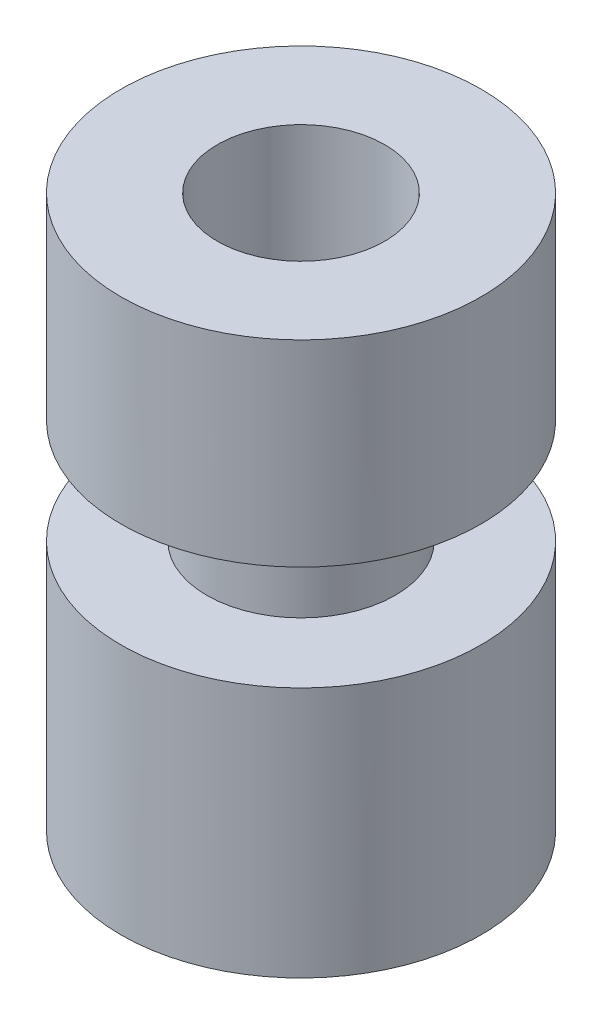
ISO-10303-21;
HEADER;
FILE_DESCRIPTION(('STEP AP214'),'2;1');
FILE_NAME('part.step','',(''),(''),'','','');
FILE_SCHEMA(('AUTOMOTIVE_DESIGN { 1 0 10303 214 1 1 1 1 }'));
ENDSEC;
DATA;
#1=APPLICATION_CONTEXT('core data for automotive mechanical design processes');
#2=APPLICATION_PROTOCOL_DEFINITION('international standard','automotive_design',2000,#1);
#3=PRODUCT_CONTEXT('',#1,'mechanical');
#4=PRODUCT('Part','Part','',(#3));
#5=PRODUCT_RELATED_PRODUCT_CATEGORY('part','',(#4));
#6=PRODUCT_DEFINITION_FORMATION('','',#4);
#7=PRODUCT_DEFINITION_CONTEXT('part definition',#1,'design');
#8=PRODUCT_DEFINITION('design','',#6,#7);
#9=PRODUCT_DEFINITION_SHAPE('','',#8);
#10=(LENGTH_UNIT() NAMED_UNIT(*) SI_UNIT(.MILLI.,.METRE.));
#11=(NAMED_UNIT(*) PLANE_ANGLE_UNIT() SI_UNIT($,.RADIAN.));
#12=(NAMED_UNIT(*) SI_UNIT($,.STERADIAN.) SOLID_ANGLE_UNIT());
#13=UNCERTAINTY_MEASURE_WITH_UNIT(LENGTH_MEASURE(1.E-05),#10,'distance_accuracy_value','');
#14=(GEOMETRIC_REPRESENTATION_CONTEXT(3) GLOBAL_UNCERTAINTY_ASSIGNED_CONTEXT((#13)) GLOBAL_UNIT_ASSIGNED_CONTEXT((#10,
#11,#12)) REPRESENTATION_CONTEXT('',''));
#15=CARTESIAN_POINT('',(0.,0.,0.));
#16=DIRECTION('',(0.,0.,1.));
#17=DIRECTION('',(1.,0.,0.));
#18=AXIS2_PLACEMENT_3D('',#15,#16,#17);
#19=CARTESIAN_POINT('',(0.,6.6,0.));
#20=DIRECTION('',(0.,-1.,0.));
#21=DIRECTION('',(0.,0.,-1.));
#22=AXIS2_PLACEMENT_3D('',#19,#20,#21);
#23=CYLINDRICAL_SURFACE('',#22,2.15);
#24=CARTESIAN_POINT('',(0.,6.6,0.));
#25=DIRECTION('',(0.,1.,0.));
#26=DIRECTION('',(0.,0.,1.));
#27=AXIS2_PLACEMENT_3D('',#24,#25,#26);
#28=CIRCLE('',#27,2.15);
#29=CARTESIAN_POINT('',(0.,6.6,2.15));
#30=VERTEX_POINT('',#29);
#31=EDGE_CURVE('E10',#30,#30,#28,.T.);
#32=ORIENTED_EDGE('',*,*,#31,.F.);
#33=EDGE_LOOP('',(#32));
#34=FACE_BOUND('',#33,.T.);
#35=CARTESIAN_POINT('',(0.,4.25,0.));
#36=DIRECTION('',(0.,-1.,0.));
#37=DIRECTION('',(0.,0.,-1.));
#38=AXIS2_PLACEMENT_3D('',#35,#36,#37);
#39=CIRCLE('',#38,2.15);
#40=CARTESIAN_POINT('',(0.,4.25,-2.15));
#41=VERTEX_POINT('',#40);
#42=EDGE_CURVE('E58',#41,#41,#39,.T.);
#43=ORIENTED_EDGE('',*,*,#42,.F.);
#44=EDGE_LOOP('',(#43));
#45=FACE_BOUND('',#44,.T.);
#46=ADVANCED_FACE('F39',(#34,#45),#23,.T.);
#47=CARTESIAN_POINT('',(0.,3.,0.));
#48=DIRECTION('',(0.,-1.,0.));
#49=DIRECTION('',(0.,0.,-1.));
#50=AXIS2_PLACEMENT_3D('',#47,#48,#49);
#51=CIRCLE('',#50,2.15);
#52=CARTESIAN_POINT('',(0.,3.,-2.15));
#53=VERTEX_POINT('',#52);
#54=EDGE_CURVE('E55',#53,#53,#51,.T.);
#55=ORIENTED_EDGE('',*,*,#54,.T.);
#56=EDGE_LOOP('',(#55));
#57=FACE_BOUND('',#56,.T.);
#58=CARTESIAN_POINT('',(0.,0.,0.));
#59=DIRECTION('',(0.,1.,0.));
#60=DIRECTION('',(0.,0.,1.));
#61=AXIS2_PLACEMENT_3D('',#58,#59,#60);
#62=CIRCLE('',#61,2.15);
#63=CARTESIAN_POINT('',(0.,0.,2.15));
#64=VERTEX_POINT('',#63);
#65=EDGE_CURVE('E43',#64,#64,#62,.T.);
#66=ORIENTED_EDGE('',*,*,#65,.T.);
#67=EDGE_LOOP('',(#66));
#68=FACE_BOUND('',#67,.T.);
#69=ADVANCED_FACE('F41',(#57,#68),#23,.T.);
#70=CARTESIAN_POINT('',(0.,6.6,0.));
#71=DIRECTION('',(0.,1.,0.));
#72=DIRECTION('',(0.,0.,1.));
#73=AXIS2_PLACEMENT_3D('',#70,#71,#72);
#74=PLANE('',#73);
#75=CARTESIAN_POINT('',(0.,6.6,0.));
#76=DIRECTION('',(0.,-1.,0.));
#77=DIRECTION('',(0.,0.,-1.));
#78=AXIS2_PLACEMENT_3D('',#75,#76,#77);
#79=CIRCLE('',#78,1.);
#80=CARTESIAN_POINT('',(0.,6.6,-1.));
#81=VERTEX_POINT('',#80);
#82=EDGE_CURVE('E50',#81,#81,#79,.T.);
#83=ORIENTED_EDGE('',*,*,#82,.T.);
#84=EDGE_LOOP('',(#83));
#85=FACE_BOUND('',#84,.T.);
#86=ORIENTED_EDGE('',*,*,#31,.T.);
#87=EDGE_LOOP('',(#86));
#88=FACE_BOUND('',#87,.T.);
#89=ADVANCED_FACE('F95',(#85,#88),#74,.T.);
#90=CARTESIAN_POINT('',(0.,0.,0.));
#91=DIRECTION('',(0.,1.,0.));
#92=DIRECTION('',(0.,0.,1.));
#93=AXIS2_PLACEMENT_3D('',#90,#91,#92);
#94=PLANE('',#93);
#95=CARTESIAN_POINT('',(0.,0.,0.));
#96=DIRECTION('',(0.,-1.,0.));
#97=DIRECTION('',(0.,0.,-1.));
#98=AXIS2_PLACEMENT_3D('',#95,#96,#97);
#99=CIRCLE('',#98,1.);
#100=CARTESIAN_POINT('',(0.,0.,-1.));
#101=VERTEX_POINT('',#100);
#102=EDGE_CURVE('E52',#101,#101,#99,.T.);
#103=ORIENTED_EDGE('',*,*,#102,.F.);
#104=EDGE_LOOP('',(#103));
#105=FACE_BOUND('',#104,.T.);
#106=ORIENTED_EDGE('',*,*,#65,.F.);
#107=EDGE_LOOP('',(#106));
#108=FACE_BOUND('',#107,.T.);
#109=ADVANCED_FACE('F102',(#105,#108),#94,.F.);
#110=CARTESIAN_POINT('',(0.,6.6,0.));
#111=DIRECTION('',(0.,-1.,0.));
#112=DIRECTION('',(0.,0.,-1.));
#113=AXIS2_PLACEMENT_3D('',#110,#111,#112);
#114=CYLINDRICAL_SURFACE('',#113,1.);
#115=ORIENTED_EDGE('',*,*,#82,.F.);
#116=EDGE_LOOP('',(#115));
#117=FACE_BOUND('',#116,.T.);
#118=ORIENTED_EDGE('',*,*,#102,.T.);
#119=EDGE_LOOP('',(#118));
#120=FACE_BOUND('',#119,.T.);
#121=ADVANCED_FACE('F85',(#117,#120),#114,.F.);
#122=CARTESIAN_POINT('',(0.,3.,0.));
#123=DIRECTION('',(0.,-1.,0.));
#124=DIRECTION('',(0.,0.,-1.));
#125=AXIS2_PLACEMENT_3D('',#122,#123,#124);
#126=PLANE('',#125);
#127=ORIENTED_EDGE('',*,*,#54,.F.);
#128=EDGE_LOOP('',(#127));
#129=FACE_BOUND('',#128,.T.);
#130=CARTESIAN_POINT('',(0.,3.,0.));
#131=DIRECTION('',(0.,-1.,0.));
#132=DIRECTION('',(0.,0.,-1.));
#133=AXIS2_PLACEMENT_3D('',#130,#131,#132);
#134=CIRCLE('',#133,1.125);
#135=CARTESIAN_POINT('',(0.,3.,-1.125));
#136=VERTEX_POINT('',#135);
#137=EDGE_CURVE('E61',#136,#136,#134,.T.);
#138=ORIENTED_EDGE('',*,*,#137,.T.);
#139=EDGE_LOOP('',(#138));
#140=FACE_BOUND('',#139,.T.);
#141=ADVANCED_FACE('F70',(#129,#140),#126,.F.);
#142=CARTESIAN_POINT('',(0.,4.25,0.));
#143=DIRECTION('',(0.,-1.,0.));
#144=DIRECTION('',(0.,0.,-1.));
#145=AXIS2_PLACEMENT_3D('',#142,#143,#144);
#146=PLANE('',#145);
#147=ORIENTED_EDGE('',*,*,#42,.T.);
#148=EDGE_LOOP('',(#147));
#149=FACE_BOUND('',#148,.T.);
#150=CARTESIAN_POINT('',(0.,4.25,0.));
#151=DIRECTION('',(0.,-1.,0.));
#152=DIRECTION('',(0.,0.,-1.));
#153=AXIS2_PLACEMENT_3D('',#150,#151,#152);
#154=CIRCLE('',#153,1.125);
#155=CARTESIAN_POINT('',(0.,4.25,-1.125));
#156=VERTEX_POINT('',#155);
#157=EDGE_CURVE('E64',#156,#156,#154,.T.);
#158=ORIENTED_EDGE('',*,*,#157,.F.);
#159=EDGE_LOOP('',(#158));
#160=FACE_BOUND('',#159,.T.);
#161=ADVANCED_FACE('F75',(#149,#160),#146,.T.);
#162=CARTESIAN_POINT('',(0.,3.,0.));
#163=DIRECTION('',(0.,1.,0.));
#164=DIRECTION('',(0.,0.,1.));
#165=AXIS2_PLACEMENT_3D('',#162,#163,#164);
#166=CYLINDRICAL_SURFACE('',#165,1.125);
#167=ORIENTED_EDGE('',*,*,#137,.F.);
#168=EDGE_LOOP('',(#167));
#169=FACE_BOUND('',#168,.T.);
#170=ORIENTED_EDGE('',*,*,#157,.T.);
#171=EDGE_LOOP('',(#170));
#172=FACE_BOUND('',#171,.T.);
#173=ADVANCED_FACE('F72',(#169,#172),#166,.T.);
#174=CLOSED_SHELL('',(#46,#69,#89,#109,#121,#141,#161,#173));
#175=MANIFOLD_SOLID_BREP('B2',#174);
#176=ADVANCED_BREP_SHAPE_REPRESENTATION('',(#18,#175),#14);
#177=SHAPE_DEFINITION_REPRESENTATION(#9,#176);
ENDSEC;
END-ISO-10303-21;
